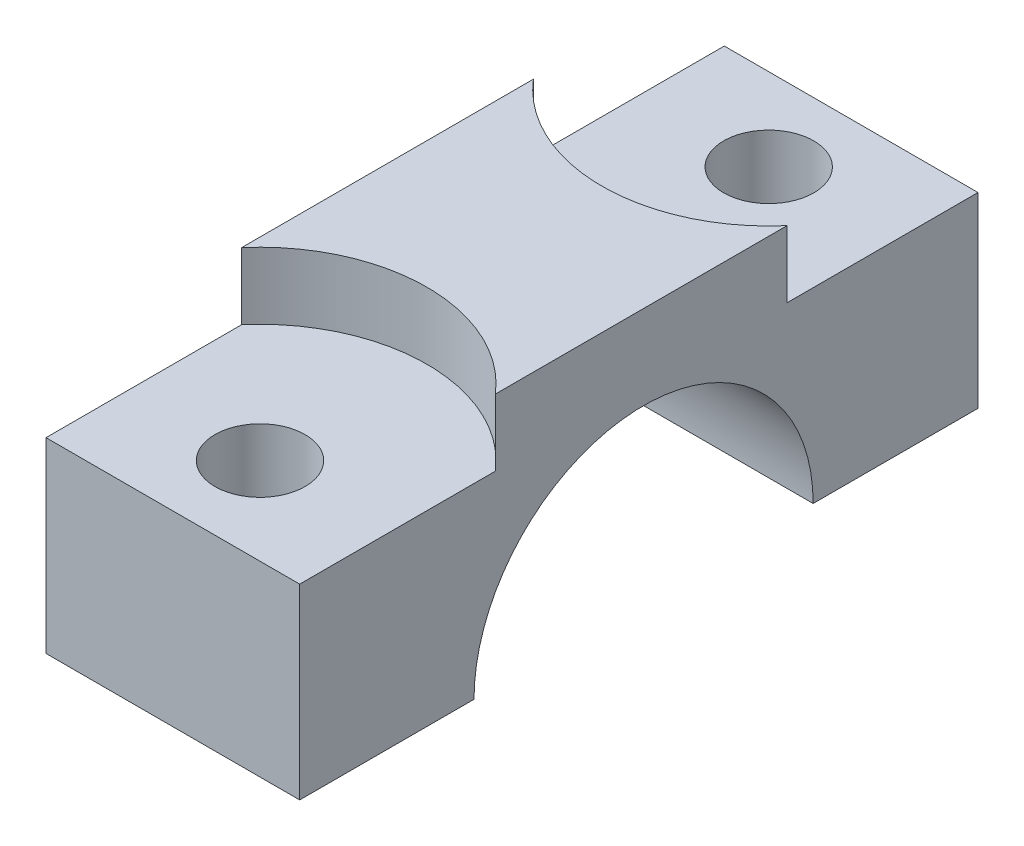
ISO-10303-21;
HEADER;
FILE_DESCRIPTION(('STEP AP214'),'2;1');
FILE_NAME('part.step','',(''),(''),'','','');
FILE_SCHEMA(('AUTOMOTIVE_DESIGN { 1 0 10303 214 1 1 1 1 }'));
ENDSEC;
DATA;
#1=APPLICATION_CONTEXT('core data for automotive mechanical design processes');
#2=APPLICATION_PROTOCOL_DEFINITION('international standard','automotive_design',2000,#1);
#3=PRODUCT_CONTEXT('',#1,'mechanical');
#4=PRODUCT('Part','Part','',(#3));
#5=PRODUCT_RELATED_PRODUCT_CATEGORY('part','',(#4));
#6=PRODUCT_DEFINITION_FORMATION('','',#4);
#7=PRODUCT_DEFINITION_CONTEXT('part definition',#1,'design');
#8=PRODUCT_DEFINITION('design','',#6,#7);
#9=PRODUCT_DEFINITION_SHAPE('','',#8);
#10=(LENGTH_UNIT() NAMED_UNIT(*) SI_UNIT(.MILLI.,.METRE.));
#11=(NAMED_UNIT(*) PLANE_ANGLE_UNIT() SI_UNIT($,.RADIAN.));
#12=(NAMED_UNIT(*) SI_UNIT($,.STERADIAN.) SOLID_ANGLE_UNIT());
#13=UNCERTAINTY_MEASURE_WITH_UNIT(LENGTH_MEASURE(1.E-05),#10,'distance_accuracy_value','');
#14=(GEOMETRIC_REPRESENTATION_CONTEXT(3) GLOBAL_UNCERTAINTY_ASSIGNED_CONTEXT((#13)) GLOBAL_UNIT_ASSIGNED_CONTEXT((#10,
#11,#12)) REPRESENTATION_CONTEXT('',''));
#15=CARTESIAN_POINT('',(0.,0.,0.));
#16=DIRECTION('',(0.,0.,1.));
#17=DIRECTION('',(1.,0.,0.));
#18=AXIS2_PLACEMENT_3D('',#15,#16,#17);
#19=CARTESIAN_POINT('',(9.5,0.,0.));
#20=DIRECTION('',(-1.,0.,0.));
#21=DIRECTION('',(0.,0.,1.));
#22=AXIS2_PLACEMENT_3D('',#19,#20,#21);
#23=CYLINDRICAL_SURFACE('',#22,12.7);
#24=CARTESIAN_POINT('',(-9.5,0.,0.));
#25=DIRECTION('',(1.,0.,0.));
#26=DIRECTION('',(0.,0.,-1.));
#27=AXIS2_PLACEMENT_3D('',#24,#25,#26);
#28=CIRCLE('',#27,12.7);
#29=CARTESIAN_POINT('',(-9.5,0.,-12.7));
#30=VERTEX_POINT('',#29);
#31=CARTESIAN_POINT('',(-9.5,0.,12.7));
#32=VERTEX_POINT('',#31);
#33=EDGE_CURVE('E178',#30,#32,#28,.T.);
#34=ORIENTED_EDGE('',*,*,#33,.F.);
#35=DIRECTION('',(-1.,0.,0.));
#36=VECTOR('',#35,1.);
#37=CARTESIAN_POINT('',(9.5,0.,-12.7));
#38=LINE('',#37,#36);
#39=CARTESIAN_POINT('',(9.5,0.,-12.7));
#40=VERTEX_POINT('',#39);
#41=EDGE_CURVE('E224',#40,#30,#38,.T.);
#42=ORIENTED_EDGE('',*,*,#41,.F.);
#43=CARTESIAN_POINT('',(9.5,0.,0.));
#44=DIRECTION('',(1.,0.,0.));
#45=DIRECTION('',(0.,0.,-1.));
#46=AXIS2_PLACEMENT_3D('',#43,#44,#45);
#47=CIRCLE('',#46,12.7);
#48=CARTESIAN_POINT('',(9.5,0.,12.7));
#49=VERTEX_POINT('',#48);
#50=EDGE_CURVE('E179',#40,#49,#47,.T.);
#51=ORIENTED_EDGE('',*,*,#50,.T.);
#52=DIRECTION('',(-1.,0.,0.));
#53=VECTOR('',#52,1.);
#54=CARTESIAN_POINT('',(9.5,0.,12.7));
#55=LINE('',#54,#53);
#56=EDGE_CURVE('E213',#49,#32,#55,.T.);
#57=ORIENTED_EDGE('',*,*,#56,.T.);
#58=EDGE_LOOP('',(#34,#42,#51,#57));
#59=FACE_BOUND('',#58,.T.);
#60=ADVANCED_FACE('F45',(#59),#23,.F.);
#61=CARTESIAN_POINT('',(9.5,0.,0.));
#62=DIRECTION('',(0.,1.,0.));
#63=DIRECTION('',(0.,0.,1.));
#64=AXIS2_PLACEMENT_3D('',#61,#62,#63);
#65=PLANE('',#64);
#66=CARTESIAN_POINT('',(0.,0.,-18.8727906976744));
#67=DIRECTION('',(0.,1.,0.));
#68=DIRECTION('',(0.,0.,1.));
#69=AXIS2_PLACEMENT_3D('',#66,#67,#68);
#70=CIRCLE('',#69,3.375);
#71=CARTESIAN_POINT('',(0.,0.,-15.4977906976744));
#72=VERTEX_POINT('',#71);
#73=EDGE_CURVE('E163',#72,#72,#70,.T.);
#74=ORIENTED_EDGE('',*,*,#73,.T.);
#75=EDGE_LOOP('',(#74));
#76=FACE_BOUND('',#75,.T.);
#77=DIRECTION('',(0.,0.,-1.));
#78=VECTOR('',#77,1.);
#79=CARTESIAN_POINT('',(-9.5,0.,0.));
#80=LINE('',#79,#78);
#81=CARTESIAN_POINT('',(-9.5,0.,-25.0455813953489));
#82=VERTEX_POINT('',#81);
#83=EDGE_CURVE('E200',#30,#82,#80,.T.);
#84=ORIENTED_EDGE('',*,*,#83,.T.);
#85=DIRECTION('',(-1.,0.,0.));
#86=VECTOR('',#85,1.);
#87=CARTESIAN_POINT('',(9.5,0.,-25.0455813953489));
#88=LINE('',#87,#86);
#89=CARTESIAN_POINT('',(9.5,0.,-25.0455813953489));
#90=VERTEX_POINT('',#89);
#91=EDGE_CURVE('E220',#90,#82,#88,.T.);
#92=ORIENTED_EDGE('',*,*,#91,.F.);
#93=DIRECTION('',(0.,0.,-1.));
#94=VECTOR('',#93,1.);
#95=CARTESIAN_POINT('',(9.5,0.,0.));
#96=LINE('',#95,#94);
#97=EDGE_CURVE('E183',#40,#90,#96,.T.);
#98=ORIENTED_EDGE('',*,*,#97,.F.);
#99=ORIENTED_EDGE('',*,*,#41,.T.);
#100=EDGE_LOOP('',(#84,#92,#98,#99));
#101=FACE_BOUND('',#100,.T.);
#102=ADVANCED_FACE('F276',(#76,#101),#65,.F.);
#103=CARTESIAN_POINT('',(9.5,0.,-25.0455813953489));
#104=DIRECTION('',(0.,0.,-1.));
#105=DIRECTION('',(0.,1.,0.));
#106=AXIS2_PLACEMENT_3D('',#103,#104,#105);
#107=PLANE('',#106);
#108=DIRECTION('',(-1.,0.,0.));
#109=VECTOR('',#108,1.);
#110=CARTESIAN_POINT('',(9.5,14.,-25.0455813953488));
#111=LINE('',#110,#109);
#112=CARTESIAN_POINT('',(9.5,14.,-25.0455813953489));
#113=VERTEX_POINT('',#112);
#114=CARTESIAN_POINT('',(-9.5,14.,-25.0455813953488));
#115=VERTEX_POINT('',#114);
#116=EDGE_CURVE('E171',#113,#115,#111,.T.);
#117=ORIENTED_EDGE('',*,*,#116,.F.);
#118=DIRECTION('',(0.,-1.,0.));
#119=VECTOR('',#118,1.);
#120=CARTESIAN_POINT('',(9.5,0.,-25.0455813953489));
#121=LINE('',#120,#119);
#122=EDGE_CURVE('E188',#113,#90,#121,.T.);
#123=ORIENTED_EDGE('',*,*,#122,.T.);
#124=ORIENTED_EDGE('',*,*,#91,.T.);
#125=DIRECTION('',(0.,-1.,0.));
#126=VECTOR('',#125,1.);
#127=CARTESIAN_POINT('',(-9.5,0.,-25.0455813953489));
#128=LINE('',#127,#126);
#129=EDGE_CURVE('E204',#115,#82,#128,.T.);
#130=ORIENTED_EDGE('',*,*,#129,.F.);
#131=EDGE_LOOP('',(#117,#123,#124,#130));
#132=FACE_BOUND('',#131,.T.);
#133=ADVANCED_FACE('F249',(#132),#107,.T.);
#134=CARTESIAN_POINT('',(9.5,19.,0.));
#135=DIRECTION('',(0.,1.,0.));
#136=DIRECTION('',(0.,0.,1.));
#137=AXIS2_PLACEMENT_3D('',#134,#135,#136);
#138=PLANE('',#137);
#139=CARTESIAN_POINT('',(0.,19.,19.2272093023256));
#140=DIRECTION('',(0.,1.,0.));
#141=DIRECTION('',(0.,0.,1.));
#142=AXIS2_PLACEMENT_3D('',#139,#140,#141);
#143=CIRCLE('',#142,12.5);
#144=CARTESIAN_POINT('',(9.5,19.,11.1031708976896));
#145=VERTEX_POINT('',#144);
#146=CARTESIAN_POINT('',(-9.5,19.,11.1031708976896));
#147=VERTEX_POINT('',#146);
#148=EDGE_CURVE('E60',#145,#147,#143,.T.);
#149=ORIENTED_EDGE('',*,*,#148,.F.);
#150=DIRECTION('',(0.,0.,-1.));
#151=VECTOR('',#150,1.);
#152=CARTESIAN_POINT('',(9.5,19.,0.));
#153=LINE('',#152,#151);
#154=CARTESIAN_POINT('',(9.5,19.,-10.7487522930385));
#155=VERTEX_POINT('',#154);
#156=EDGE_CURVE('E67',#145,#155,#153,.T.);
#157=ORIENTED_EDGE('',*,*,#156,.T.);
#158=CARTESIAN_POINT('',(0.,19.,-18.8727906976744));
#159=DIRECTION('',(0.,1.,0.));
#160=DIRECTION('',(0.,0.,1.));
#161=AXIS2_PLACEMENT_3D('',#158,#159,#160);
#162=CIRCLE('',#161,12.5);
#163=CARTESIAN_POINT('',(-9.5,19.,-10.7487522930385));
#164=VERTEX_POINT('',#163);
#165=EDGE_CURVE('E134',#164,#155,#162,.T.);
#166=ORIENTED_EDGE('',*,*,#165,.F.);
#167=DIRECTION('',(0.,0.,-1.));
#168=VECTOR('',#167,1.);
#169=CARTESIAN_POINT('',(-9.5,19.,0.));
#170=LINE('',#169,#168);
#171=EDGE_CURVE('E207',#147,#164,#170,.T.);
#172=ORIENTED_EDGE('',*,*,#171,.F.);
#173=EDGE_LOOP('',(#149,#157,#166,#172));
#174=FACE_BOUND('',#173,.T.);
#175=ADVANCED_FACE('F238',(#174),#138,.T.);
#176=CARTESIAN_POINT('',(9.5,0.,25.7544186046511));
#177=DIRECTION('',(0.,0.,-1.));
#178=DIRECTION('',(0.,1.,0.));
#179=AXIS2_PLACEMENT_3D('',#176,#177,#178);
#180=PLANE('',#179);
#181=DIRECTION('',(0.,-1.,0.));
#182=VECTOR('',#181,1.);
#183=CARTESIAN_POINT('',(9.5,0.,25.7544186046511));
#184=LINE('',#183,#182);
#185=CARTESIAN_POINT('',(9.5,14.,25.7544186046512));
#186=VERTEX_POINT('',#185);
#187=CARTESIAN_POINT('',(9.5,0.,25.7544186046511));
#188=VERTEX_POINT('',#187);
#189=EDGE_CURVE('E194',#186,#188,#184,.T.);
#190=ORIENTED_EDGE('',*,*,#189,.F.);
#191=DIRECTION('',(-1.,0.,0.));
#192=VECTOR('',#191,1.);
#193=CARTESIAN_POINT('',(9.5,14.,25.7544186046512));
#194=LINE('',#193,#192);
#195=CARTESIAN_POINT('',(-9.5,14.,25.7544186046512));
#196=VERTEX_POINT('',#195);
#197=EDGE_CURVE('E129',#186,#196,#194,.T.);
#198=ORIENTED_EDGE('',*,*,#197,.T.);
#199=DIRECTION('',(0.,-1.,0.));
#200=VECTOR('',#199,1.);
#201=CARTESIAN_POINT('',(-9.5,0.,25.7544186046511));
#202=LINE('',#201,#200);
#203=CARTESIAN_POINT('',(-9.5,0.,25.7544186046511));
#204=VERTEX_POINT('',#203);
#205=EDGE_CURVE('E210',#196,#204,#202,.T.);
#206=ORIENTED_EDGE('',*,*,#205,.T.);
#207=DIRECTION('',(-1.,0.,0.));
#208=VECTOR('',#207,1.);
#209=CARTESIAN_POINT('',(9.5,0.,25.7544186046511));
#210=LINE('',#209,#208);
#211=EDGE_CURVE('E216',#188,#204,#210,.T.);
#212=ORIENTED_EDGE('',*,*,#211,.F.);
#213=EDGE_LOOP('',(#190,#198,#206,#212));
#214=FACE_BOUND('',#213,.T.);
#215=ADVANCED_FACE('F267',(#214),#180,.F.);
#216=CARTESIAN_POINT('',(0.,0.,19.2272093023256));
#217=DIRECTION('',(0.,1.,0.));
#218=DIRECTION('',(0.,0.,1.));
#219=AXIS2_PLACEMENT_3D('',#216,#217,#218);
#220=CIRCLE('',#219,3.375);
#221=CARTESIAN_POINT('',(0.,0.,22.6022093023256));
#222=VERTEX_POINT('',#221);
#223=EDGE_CURVE('E144',#222,#222,#220,.T.);
#224=ORIENTED_EDGE('',*,*,#223,.T.);
#225=EDGE_LOOP('',(#224));
#226=FACE_BOUND('',#225,.T.);
#227=EDGE_CURVE('E184',#204,#32,#80,.T.);
#228=ORIENTED_EDGE('',*,*,#227,.T.);
#229=ORIENTED_EDGE('',*,*,#56,.F.);
#230=EDGE_CURVE('E189',#188,#49,#96,.T.);
#231=ORIENTED_EDGE('',*,*,#230,.F.);
#232=ORIENTED_EDGE('',*,*,#211,.T.);
#233=EDGE_LOOP('',(#228,#229,#231,#232));
#234=FACE_BOUND('',#233,.T.);
#235=ADVANCED_FACE('F262',(#226,#234),#65,.F.);
#236=CARTESIAN_POINT('',(9.5,0.,0.));
#237=DIRECTION('',(1.,0.,0.));
#238=DIRECTION('',(0.,0.,-1.));
#239=AXIS2_PLACEMENT_3D('',#236,#237,#238);
#240=PLANE('',#239);
#241=DIRECTION('',(0.,0.,-1.));
#242=VECTOR('',#241,1.);
#243=CARTESIAN_POINT('',(9.5,14.,0.));
#244=LINE('',#243,#242);
#245=CARTESIAN_POINT('',(9.5,14.,11.1031708976896));
#246=VERTEX_POINT('',#245);
#247=EDGE_CURVE('E123',#186,#246,#244,.T.);
#248=ORIENTED_EDGE('',*,*,#247,.F.);
#249=ORIENTED_EDGE('',*,*,#189,.T.);
#250=ORIENTED_EDGE('',*,*,#230,.T.);
#251=ORIENTED_EDGE('',*,*,#50,.F.);
#252=ORIENTED_EDGE('',*,*,#97,.T.);
#253=ORIENTED_EDGE('',*,*,#122,.F.);
#254=DIRECTION('',(0.,0.,-1.));
#255=VECTOR('',#254,1.);
#256=CARTESIAN_POINT('',(9.5,14.,0.));
#257=LINE('',#256,#255);
#258=CARTESIAN_POINT('',(9.5,14.,-10.7487522930385));
#259=VERTEX_POINT('',#258);
#260=EDGE_CURVE('E230',#259,#113,#257,.T.);
#261=ORIENTED_EDGE('',*,*,#260,.F.);
#262=DIRECTION('',(0.,1.,0.));
#263=VECTOR('',#262,1.);
#264=CARTESIAN_POINT('',(9.5,19.,-10.7487522930385));
#265=LINE('',#264,#263);
#266=EDGE_CURVE('E227',#155,#259,#265,.F.);
#267=ORIENTED_EDGE('',*,*,#266,.F.);
#268=ORIENTED_EDGE('',*,*,#156,.F.);
#269=DIRECTION('',(0.,1.,0.));
#270=VECTOR('',#269,1.);
#271=CARTESIAN_POINT('',(9.5,19.,11.1031708976896));
#272=LINE('',#271,#270);
#273=EDGE_CURVE('E137',#246,#145,#272,.T.);
#274=ORIENTED_EDGE('',*,*,#273,.F.);
#275=EDGE_LOOP('',(#248,#249,#250,#251,#252,#253,#261,#267,#268,#274));
#276=FACE_BOUND('',#275,.T.);
#277=ADVANCED_FACE('F141',(#276),#240,.T.);
#278=CARTESIAN_POINT('',(-9.5,0.,0.));
#279=DIRECTION('',(1.,0.,0.));
#280=DIRECTION('',(0.,0.,-1.));
#281=AXIS2_PLACEMENT_3D('',#278,#279,#280);
#282=PLANE('',#281);
#283=ORIENTED_EDGE('',*,*,#205,.F.);
#284=DIRECTION('',(0.,0.,-1.));
#285=VECTOR('',#284,1.);
#286=CARTESIAN_POINT('',(-9.5,14.,0.));
#287=LINE('',#286,#285);
#288=CARTESIAN_POINT('',(-9.5,14.,11.1031708976896));
#289=VERTEX_POINT('',#288);
#290=EDGE_CURVE('E11',#196,#289,#287,.T.);
#291=ORIENTED_EDGE('',*,*,#290,.T.);
#292=DIRECTION('',(0.,1.,0.));
#293=VECTOR('',#292,1.);
#294=CARTESIAN_POINT('',(-9.5,19.,11.1031708976896));
#295=LINE('',#294,#293);
#296=EDGE_CURVE('E53',#289,#147,#295,.T.);
#297=ORIENTED_EDGE('',*,*,#296,.T.);
#298=ORIENTED_EDGE('',*,*,#171,.T.);
#299=DIRECTION('',(0.,1.,0.));
#300=VECTOR('',#299,1.);
#301=CARTESIAN_POINT('',(-9.5,19.,-10.7487522930385));
#302=LINE('',#301,#300);
#303=CARTESIAN_POINT('',(-9.5,14.,-10.7487522930385));
#304=VERTEX_POINT('',#303);
#305=EDGE_CURVE('E167',#164,#304,#302,.F.);
#306=ORIENTED_EDGE('',*,*,#305,.T.);
#307=DIRECTION('',(0.,0.,-1.));
#308=VECTOR('',#307,1.);
#309=CARTESIAN_POINT('',(-9.5,14.,0.));
#310=LINE('',#309,#308);
#311=EDGE_CURVE('E174',#304,#115,#310,.T.);
#312=ORIENTED_EDGE('',*,*,#311,.T.);
#313=ORIENTED_EDGE('',*,*,#129,.T.);
#314=ORIENTED_EDGE('',*,*,#83,.F.);
#315=ORIENTED_EDGE('',*,*,#33,.T.);
#316=ORIENTED_EDGE('',*,*,#227,.F.);
#317=EDGE_LOOP('',(#283,#291,#297,#298,#306,#312,#313,#314,#315,#316));
#318=FACE_BOUND('',#317,.T.);
#319=ADVANCED_FACE('F236',(#318),#282,.F.);
#320=CARTESIAN_POINT('',(3.37500000000001,14.,-18.8727906976744));
#321=DIRECTION('',(0.,-1.,0.));
#322=DIRECTION('',(0.,0.,-1.));
#323=AXIS2_PLACEMENT_3D('',#320,#321,#322);
#324=PLANE('',#323);
#325=CARTESIAN_POINT('',(0.,14.,-18.8727906976744));
#326=DIRECTION('',(0.,1.,0.));
#327=DIRECTION('',(0.,0.,1.));
#328=AXIS2_PLACEMENT_3D('',#325,#326,#327);
#329=CIRCLE('',#328,3.37500000000001);
#330=CARTESIAN_POINT('',(0.,14.,-15.4977906976744));
#331=VERTEX_POINT('',#330);
#332=EDGE_CURVE('E159',#331,#331,#329,.T.);
#333=ORIENTED_EDGE('',*,*,#332,.F.);
#334=EDGE_LOOP('',(#333));
#335=FACE_BOUND('',#334,.T.);
#336=CARTESIAN_POINT('',(0.,14.,-18.8727906976744));
#337=DIRECTION('',(0.,1.,0.));
#338=DIRECTION('',(0.,0.,1.));
#339=AXIS2_PLACEMENT_3D('',#336,#337,#338);
#340=CIRCLE('',#339,12.5);
#341=EDGE_CURVE('E155',#304,#259,#340,.T.);
#342=ORIENTED_EDGE('',*,*,#341,.T.);
#343=ORIENTED_EDGE('',*,*,#260,.T.);
#344=ORIENTED_EDGE('',*,*,#116,.T.);
#345=ORIENTED_EDGE('',*,*,#311,.F.);
#346=EDGE_LOOP('',(#342,#343,#344,#345));
#347=FACE_BOUND('',#346,.T.);
#348=ADVANCED_FACE('F246',(#335,#347),#324,.F.);
#349=CARTESIAN_POINT('',(0.,19.,-18.8727906976744));
#350=DIRECTION('',(0.,1.,0.));
#351=DIRECTION('',(0.,0.,1.));
#352=AXIS2_PLACEMENT_3D('',#349,#350,#351);
#353=CYLINDRICAL_SURFACE('',#352,12.5);
#354=ORIENTED_EDGE('',*,*,#165,.T.);
#355=ORIENTED_EDGE('',*,*,#266,.T.);
#356=ORIENTED_EDGE('',*,*,#341,.F.);
#357=ORIENTED_EDGE('',*,*,#305,.F.);
#358=EDGE_LOOP('',(#354,#355,#356,#357));
#359=FACE_BOUND('',#358,.T.);
#360=ADVANCED_FACE('F240',(#359),#353,.F.);
#361=CARTESIAN_POINT('',(0.,19.,-18.8727906976744));
#362=DIRECTION('',(0.,1.,0.));
#363=DIRECTION('',(0.,0.,1.));
#364=AXIS2_PLACEMENT_3D('',#361,#362,#363);
#365=CYLINDRICAL_SURFACE('',#364,3.375);
#366=ORIENTED_EDGE('',*,*,#73,.F.);
#367=EDGE_LOOP('',(#366));
#368=FACE_BOUND('',#367,.T.);
#369=ORIENTED_EDGE('',*,*,#332,.T.);
#370=EDGE_LOOP('',(#369));
#371=FACE_BOUND('',#370,.T.);
#372=ADVANCED_FACE('F291',(#368,#371),#365,.F.);
#373=CARTESIAN_POINT('',(0.,19.,19.2272093023256));
#374=DIRECTION('',(0.,1.,0.));
#375=DIRECTION('',(0.,0.,1.));
#376=AXIS2_PLACEMENT_3D('',#373,#374,#375);
#377=CYLINDRICAL_SURFACE('',#376,3.375);
#378=ORIENTED_EDGE('',*,*,#223,.F.);
#379=EDGE_LOOP('',(#378));
#380=FACE_BOUND('',#379,.T.);
#381=CARTESIAN_POINT('',(0.,14.,19.2272093023256));
#382=DIRECTION('',(0.,1.,0.));
#383=DIRECTION('',(0.,0.,1.));
#384=AXIS2_PLACEMENT_3D('',#381,#382,#383);
#385=CIRCLE('',#384,3.37500000000001);
#386=CARTESIAN_POINT('',(0.,14.,22.6022093023256));
#387=VERTEX_POINT('',#386);
#388=EDGE_CURVE('E139',#387,#387,#385,.T.);
#389=ORIENTED_EDGE('',*,*,#388,.T.);
#390=EDGE_LOOP('',(#389));
#391=FACE_BOUND('',#390,.T.);
#392=ADVANCED_FACE('F294',(#380,#391),#377,.F.);
#393=CARTESIAN_POINT('',(3.37500000000001,14.,19.2272093023256));
#394=DIRECTION('',(0.,-1.,0.));
#395=DIRECTION('',(0.,0.,-1.));
#396=AXIS2_PLACEMENT_3D('',#393,#394,#395);
#397=PLANE('',#396);
#398=ORIENTED_EDGE('',*,*,#247,.T.);
#399=CARTESIAN_POINT('',(0.,14.,19.2272093023256));
#400=DIRECTION('',(0.,1.,0.));
#401=DIRECTION('',(0.,0.,1.));
#402=AXIS2_PLACEMENT_3D('',#399,#400,#401);
#403=CIRCLE('',#402,12.5);
#404=EDGE_CURVE('E127',#246,#289,#403,.T.);
#405=ORIENTED_EDGE('',*,*,#404,.T.);
#406=ORIENTED_EDGE('',*,*,#290,.F.);
#407=ORIENTED_EDGE('',*,*,#197,.F.);
#408=EDGE_LOOP('',(#398,#405,#406,#407));
#409=FACE_BOUND('',#408,.T.);
#410=ORIENTED_EDGE('',*,*,#388,.F.);
#411=EDGE_LOOP('',(#410));
#412=FACE_BOUND('',#411,.T.);
#413=ADVANCED_FACE('F125',(#409,#412),#397,.F.);
#414=CARTESIAN_POINT('',(0.,19.,19.2272093023256));
#415=DIRECTION('',(0.,1.,0.));
#416=DIRECTION('',(0.,0.,1.));
#417=AXIS2_PLACEMENT_3D('',#414,#415,#416);
#418=CYLINDRICAL_SURFACE('',#417,12.5);
#419=ORIENTED_EDGE('',*,*,#273,.T.);
#420=ORIENTED_EDGE('',*,*,#148,.T.);
#421=ORIENTED_EDGE('',*,*,#296,.F.);
#422=ORIENTED_EDGE('',*,*,#404,.F.);
#423=EDGE_LOOP('',(#419,#420,#421,#422));
#424=FACE_BOUND('',#423,.T.);
#425=ADVANCED_FACE('F136',(#424),#418,.F.);
#426=CLOSED_SHELL('',(#60,#102,#133,#175,#215,#235,#277,#319,#348,#360,#372,#392,#413,#425));
#427=MANIFOLD_SOLID_BREP('B2',#426);
#428=ADVANCED_BREP_SHAPE_REPRESENTATION('',(#18,#427),#14);
#429=SHAPE_DEFINITION_REPRESENTATION(#9,#428);
ENDSEC;
END-ISO-10303-21;
